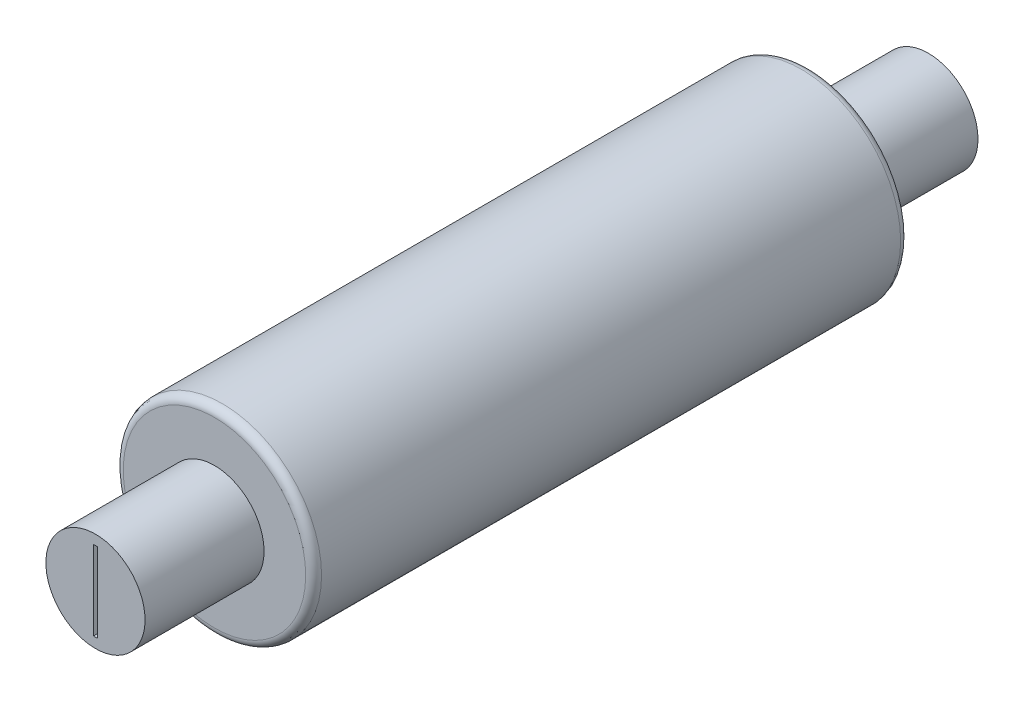
ISO-10303-21;
HEADER;
FILE_DESCRIPTION(('STEP AP214'),'2;1');
FILE_NAME('part.step','',(''),(''),'','','');
FILE_SCHEMA(('AUTOMOTIVE_DESIGN { 1 0 10303 214 1 1 1 1 }'));
ENDSEC;
DATA;
#1=APPLICATION_CONTEXT('core data for automotive mechanical design processes');
#2=APPLICATION_PROTOCOL_DEFINITION('international standard','automotive_design',2000,#1);
#3=PRODUCT_CONTEXT('',#1,'mechanical');
#4=PRODUCT('Part','Part','',(#3));
#5=PRODUCT_RELATED_PRODUCT_CATEGORY('part','',(#4));
#6=PRODUCT_DEFINITION_FORMATION('','',#4);
#7=PRODUCT_DEFINITION_CONTEXT('part definition',#1,'design');
#8=PRODUCT_DEFINITION('design','',#6,#7);
#9=PRODUCT_DEFINITION_SHAPE('','',#8);
#10=(LENGTH_UNIT() NAMED_UNIT(*) SI_UNIT(.MILLI.,.METRE.));
#11=(NAMED_UNIT(*) PLANE_ANGLE_UNIT() SI_UNIT($,.RADIAN.));
#12=(NAMED_UNIT(*) SI_UNIT($,.STERADIAN.) SOLID_ANGLE_UNIT());
#13=UNCERTAINTY_MEASURE_WITH_UNIT(LENGTH_MEASURE(1.E-05),#10,'distance_accuracy_value','');
#14=(GEOMETRIC_REPRESENTATION_CONTEXT(3) GLOBAL_UNCERTAINTY_ASSIGNED_CONTEXT((#13)) GLOBAL_UNIT_ASSIGNED_CONTEXT((#10,
#11,#12)) REPRESENTATION_CONTEXT('',''));
#15=CARTESIAN_POINT('',(0.,0.,0.));
#16=DIRECTION('',(0.,0.,1.));
#17=DIRECTION('',(1.,0.,0.));
#18=AXIS2_PLACEMENT_3D('',#15,#16,#17);
#19=CARTESIAN_POINT('',(0.,0.,75.));
#20=DIRECTION('',(0.,0.,-1.));
#21=DIRECTION('',(-1.,0.,0.));
#22=AXIS2_PLACEMENT_3D('',#19,#20,#21);
#23=CYLINDRICAL_SURFACE('',#22,25.);
#24=CARTESIAN_POINT('',(0.,0.,-73.));
#25=DIRECTION('',(0.,0.,1.));
#26=DIRECTION('',(1.,0.,0.));
#27=AXIS2_PLACEMENT_3D('',#24,#25,#26);
#28=CIRCLE('',#27,25.);
#29=CARTESIAN_POINT('',(25.,0.,-73.));
#30=VERTEX_POINT('',#29);
#31=EDGE_CURVE('E221',#30,#30,#28,.T.);
#32=ORIENTED_EDGE('',*,*,#31,.T.);
#33=EDGE_LOOP('',(#32));
#34=FACE_BOUND('',#33,.T.);
#35=CARTESIAN_POINT('',(0.,0.,73.));
#36=DIRECTION('',(0.,0.,1.));
#37=DIRECTION('',(1.,0.,0.));
#38=AXIS2_PLACEMENT_3D('',#35,#36,#37);
#39=CIRCLE('',#38,25.);
#40=CARTESIAN_POINT('',(25.,0.,73.));
#41=VERTEX_POINT('',#40);
#42=EDGE_CURVE('E217',#41,#41,#39,.F.);
#43=ORIENTED_EDGE('',*,*,#42,.T.);
#44=EDGE_LOOP('',(#43));
#45=FACE_BOUND('',#44,.T.);
#46=ADVANCED_FACE('F44',(#34,#45),#23,.T.);
#47=CARTESIAN_POINT('',(0.,0.,75.));
#48=DIRECTION('',(0.,0.,1.));
#49=DIRECTION('',(1.,0.,0.));
#50=AXIS2_PLACEMENT_3D('',#47,#48,#49);
#51=PLANE('',#50);
#52=CARTESIAN_POINT('',(0.,0.,75.));
#53=DIRECTION('',(0.,0.,1.));
#54=DIRECTION('',(1.,0.,0.));
#55=AXIS2_PLACEMENT_3D('',#52,#53,#54);
#56=CIRCLE('',#55,23.);
#57=CARTESIAN_POINT('',(23.,0.,75.));
#58=VERTEX_POINT('',#57);
#59=EDGE_CURVE('E11',#58,#58,#56,.T.);
#60=ORIENTED_EDGE('',*,*,#59,.T.);
#61=EDGE_LOOP('',(#60));
#62=FACE_BOUND('',#61,.T.);
#63=CARTESIAN_POINT('',(0.,0.,75.));
#64=DIRECTION('',(0.,0.,1.));
#65=DIRECTION('',(1.,0.,0.));
#66=AXIS2_PLACEMENT_3D('',#63,#64,#65);
#67=CIRCLE('',#66,12.5);
#68=CARTESIAN_POINT('',(12.5,0.,75.));
#69=VERTEX_POINT('',#68);
#70=EDGE_CURVE('E213',#69,#69,#67,.T.);
#71=ORIENTED_EDGE('',*,*,#70,.F.);
#72=EDGE_LOOP('',(#71));
#73=FACE_BOUND('',#72,.T.);
#74=ADVANCED_FACE('F239',(#62,#73),#51,.T.);
#75=CARTESIAN_POINT('',(0.,0.,-75.));
#76=DIRECTION('',(0.,0.,1.));
#77=DIRECTION('',(1.,0.,0.));
#78=AXIS2_PLACEMENT_3D('',#75,#76,#77);
#79=PLANE('',#78);
#80=CARTESIAN_POINT('',(0.,0.,-75.));
#81=DIRECTION('',(0.,0.,1.));
#82=DIRECTION('',(1.,0.,0.));
#83=AXIS2_PLACEMENT_3D('',#80,#81,#82);
#84=CIRCLE('',#83,23.);
#85=CARTESIAN_POINT('',(23.,0.,-75.));
#86=VERTEX_POINT('',#85);
#87=EDGE_CURVE('E53',#86,#86,#84,.F.);
#88=ORIENTED_EDGE('',*,*,#87,.T.);
#89=EDGE_LOOP('',(#88));
#90=FACE_BOUND('',#89,.T.);
#91=CARTESIAN_POINT('',(0.,0.,-75.));
#92=DIRECTION('',(0.,0.,1.));
#93=DIRECTION('',(1.,0.,0.));
#94=AXIS2_PLACEMENT_3D('',#91,#92,#93);
#95=CIRCLE('',#94,12.5);
#96=CARTESIAN_POINT('',(12.5,0.,-75.));
#97=VERTEX_POINT('',#96);
#98=EDGE_CURVE('E118',#97,#97,#95,.T.);
#99=ORIENTED_EDGE('',*,*,#98,.T.);
#100=EDGE_LOOP('',(#99));
#101=FACE_BOUND('',#100,.T.);
#102=ADVANCED_FACE('F228',(#90,#101),#79,.F.);
#103=CARTESIAN_POINT('',(0.,0.,105.));
#104=DIRECTION('',(0.,0.,1.));
#105=DIRECTION('',(1.,0.,0.));
#106=AXIS2_PLACEMENT_3D('',#103,#104,#105);
#107=PLANE('',#106);
#108=CARTESIAN_POINT('',(0.,0.,105.));
#109=DIRECTION('',(0.,0.,1.));
#110=DIRECTION('',(1.,0.,0.));
#111=AXIS2_PLACEMENT_3D('',#108,#109,#110);
#112=CIRCLE('',#111,12.5);
#113=CARTESIAN_POINT('',(12.5,0.,105.));
#114=VERTEX_POINT('',#113);
#115=EDGE_CURVE('E209',#114,#114,#112,.T.);
#116=ORIENTED_EDGE('',*,*,#115,.T.);
#117=EDGE_LOOP('',(#116));
#118=FACE_BOUND('',#117,.T.);
#119=DIRECTION('',(-1.,0.,0.));
#120=VECTOR('',#119,1.);
#121=CARTESIAN_POINT('',(-0.5,10.,105.));
#122=LINE('',#121,#120);
#123=CARTESIAN_POINT('',(0.5,10.,105.));
#124=VERTEX_POINT('',#123);
#125=CARTESIAN_POINT('',(-0.5,10.,105.));
#126=VERTEX_POINT('',#125);
#127=EDGE_CURVE('E171',#124,#126,#122,.T.);
#128=ORIENTED_EDGE('',*,*,#127,.F.);
#129=DIRECTION('',(0.,1.,0.));
#130=VECTOR('',#129,1.);
#131=CARTESIAN_POINT('',(0.5,-10.,105.));
#132=LINE('',#131,#130);
#133=CARTESIAN_POINT('',(0.5,-10.,105.));
#134=VERTEX_POINT('',#133);
#135=EDGE_CURVE('E168',#134,#124,#132,.T.);
#136=ORIENTED_EDGE('',*,*,#135,.F.);
#137=DIRECTION('',(1.,0.,0.));
#138=VECTOR('',#137,1.);
#139=CARTESIAN_POINT('',(-0.5,-10.,105.));
#140=LINE('',#139,#138);
#141=CARTESIAN_POINT('',(-0.5,-10.,105.));
#142=VERTEX_POINT('',#141);
#143=EDGE_CURVE('E179',#142,#134,#140,.T.);
#144=ORIENTED_EDGE('',*,*,#143,.F.);
#145=DIRECTION('',(0.,-1.,0.));
#146=VECTOR('',#145,1.);
#147=CARTESIAN_POINT('',(-0.5,-10.,105.));
#148=LINE('',#147,#146);
#149=EDGE_CURVE('E175',#126,#142,#148,.T.);
#150=ORIENTED_EDGE('',*,*,#149,.F.);
#151=EDGE_LOOP('',(#128,#136,#144,#150));
#152=FACE_BOUND('',#151,.T.);
#153=ADVANCED_FACE('F256',(#118,#152),#107,.T.);
#154=CARTESIAN_POINT('',(0.,0.,105.));
#155=DIRECTION('',(0.,0.,-1.));
#156=DIRECTION('',(-1.,0.,0.));
#157=AXIS2_PLACEMENT_3D('',#154,#155,#156);
#158=CYLINDRICAL_SURFACE('',#157,12.5);
#159=ORIENTED_EDGE('',*,*,#115,.F.);
#160=EDGE_LOOP('',(#159));
#161=FACE_BOUND('',#160,.T.);
#162=ORIENTED_EDGE('',*,*,#70,.T.);
#163=EDGE_LOOP('',(#162));
#164=FACE_BOUND('',#163,.T.);
#165=ADVANCED_FACE('F253',(#161,#164),#158,.T.);
#166=CARTESIAN_POINT('',(0.5,-10.,105.));
#167=DIRECTION('',(-1.,0.,0.));
#168=DIRECTION('',(0.,0.,1.));
#169=AXIS2_PLACEMENT_3D('',#166,#167,#168);
#170=PLANE('',#169);
#171=DIRECTION('',(0.,1.,0.));
#172=VECTOR('',#171,1.);
#173=CARTESIAN_POINT('',(0.5,-10.,75.));
#174=LINE('',#173,#172);
#175=CARTESIAN_POINT('',(0.5,-10.,75.));
#176=VERTEX_POINT('',#175);
#177=CARTESIAN_POINT('',(0.5,10.,75.));
#178=VERTEX_POINT('',#177);
#179=EDGE_CURVE('E164',#176,#178,#174,.T.);
#180=ORIENTED_EDGE('',*,*,#179,.F.);
#181=DIRECTION('',(0.,0.,-1.));
#182=VECTOR('',#181,1.);
#183=CARTESIAN_POINT('',(0.5,-10.,105.));
#184=LINE('',#183,#182);
#185=EDGE_CURVE('E182',#134,#176,#184,.T.);
#186=ORIENTED_EDGE('',*,*,#185,.F.);
#187=ORIENTED_EDGE('',*,*,#135,.T.);
#188=DIRECTION('',(0.,0.,-1.));
#189=VECTOR('',#188,1.);
#190=CARTESIAN_POINT('',(0.5,10.,105.));
#191=LINE('',#190,#189);
#192=EDGE_CURVE('E205',#124,#178,#191,.T.);
#193=ORIENTED_EDGE('',*,*,#192,.T.);
#194=EDGE_LOOP('',(#180,#186,#187,#193));
#195=FACE_BOUND('',#194,.T.);
#196=ADVANCED_FACE('F255',(#195),#170,.T.);
#197=CARTESIAN_POINT('',(-0.5,10.,105.));
#198=DIRECTION('',(0.,-1.,0.));
#199=DIRECTION('',(0.,0.,-1.));
#200=AXIS2_PLACEMENT_3D('',#197,#198,#199);
#201=PLANE('',#200);
#202=DIRECTION('',(-1.,0.,0.));
#203=VECTOR('',#202,1.);
#204=CARTESIAN_POINT('',(-0.5,10.,75.));
#205=LINE('',#204,#203);
#206=CARTESIAN_POINT('',(-0.5,10.,75.));
#207=VERTEX_POINT('',#206);
#208=EDGE_CURVE('E186',#178,#207,#205,.T.);
#209=ORIENTED_EDGE('',*,*,#208,.F.);
#210=ORIENTED_EDGE('',*,*,#192,.F.);
#211=ORIENTED_EDGE('',*,*,#127,.T.);
#212=DIRECTION('',(0.,0.,-1.));
#213=VECTOR('',#212,1.);
#214=CARTESIAN_POINT('',(-0.5,10.,105.));
#215=LINE('',#214,#213);
#216=EDGE_CURVE('E202',#126,#207,#215,.T.);
#217=ORIENTED_EDGE('',*,*,#216,.T.);
#218=EDGE_LOOP('',(#209,#210,#211,#217));
#219=FACE_BOUND('',#218,.T.);
#220=ADVANCED_FACE('F263',(#219),#201,.T.);
#221=CARTESIAN_POINT('',(-0.5,-10.,105.));
#222=DIRECTION('',(1.,0.,0.));
#223=DIRECTION('',(0.,0.,-1.));
#224=AXIS2_PLACEMENT_3D('',#221,#222,#223);
#225=PLANE('',#224);
#226=DIRECTION('',(0.,-1.,0.));
#227=VECTOR('',#226,1.);
#228=CARTESIAN_POINT('',(-0.5,-10.,75.));
#229=LINE('',#228,#227);
#230=CARTESIAN_POINT('',(-0.5,-10.,75.));
#231=VERTEX_POINT('',#230);
#232=EDGE_CURVE('E190',#207,#231,#229,.T.);
#233=ORIENTED_EDGE('',*,*,#232,.F.);
#234=ORIENTED_EDGE('',*,*,#216,.F.);
#235=ORIENTED_EDGE('',*,*,#149,.T.);
#236=DIRECTION('',(0.,0.,-1.));
#237=VECTOR('',#236,1.);
#238=CARTESIAN_POINT('',(-0.5,-10.,105.));
#239=LINE('',#238,#237);
#240=EDGE_CURVE('E199',#142,#231,#239,.T.);
#241=ORIENTED_EDGE('',*,*,#240,.T.);
#242=EDGE_LOOP('',(#233,#234,#235,#241));
#243=FACE_BOUND('',#242,.T.);
#244=ADVANCED_FACE('F300',(#243),#225,.T.);
#245=CARTESIAN_POINT('',(-0.5,-10.,105.));
#246=DIRECTION('',(0.,1.,0.));
#247=DIRECTION('',(0.,0.,1.));
#248=AXIS2_PLACEMENT_3D('',#245,#246,#247);
#249=PLANE('',#248);
#250=DIRECTION('',(1.,0.,0.));
#251=VECTOR('',#250,1.);
#252=CARTESIAN_POINT('',(-0.5,-10.,75.));
#253=LINE('',#252,#251);
#254=EDGE_CURVE('E172',#231,#176,#253,.T.);
#255=ORIENTED_EDGE('',*,*,#254,.F.);
#256=ORIENTED_EDGE('',*,*,#240,.F.);
#257=ORIENTED_EDGE('',*,*,#143,.T.);
#258=ORIENTED_EDGE('',*,*,#185,.T.);
#259=EDGE_LOOP('',(#255,#256,#257,#258));
#260=FACE_BOUND('',#259,.T.);
#261=ADVANCED_FACE('F297',(#260),#249,.T.);
#262=ORIENTED_EDGE('',*,*,#254,.T.);
#263=ORIENTED_EDGE('',*,*,#179,.T.);
#264=ORIENTED_EDGE('',*,*,#208,.T.);
#265=ORIENTED_EDGE('',*,*,#232,.T.);
#266=EDGE_LOOP('',(#262,#263,#264,#265));
#267=FACE_BOUND('',#266,.T.);
#268=ADVANCED_FACE('F250',(#267),#51,.T.);
#269=CARTESIAN_POINT('',(0.,0.,-105.));
#270=DIRECTION('',(0.,0.,1.));
#271=DIRECTION('',(1.,0.,0.));
#272=AXIS2_PLACEMENT_3D('',#269,#270,#271);
#273=CYLINDRICAL_SURFACE('',#272,12.5);
#274=CARTESIAN_POINT('',(0.,0.,-105.));
#275=DIRECTION('',(0.,0.,1.));
#276=DIRECTION('',(1.,0.,0.));
#277=AXIS2_PLACEMENT_3D('',#274,#275,#276);
#278=CIRCLE('',#277,12.5);
#279=CARTESIAN_POINT('',(12.5,0.,-105.));
#280=VERTEX_POINT('',#279);
#281=EDGE_CURVE('E160',#280,#280,#278,.T.);
#282=ORIENTED_EDGE('',*,*,#281,.T.);
#283=EDGE_LOOP('',(#282));
#284=FACE_BOUND('',#283,.T.);
#285=ORIENTED_EDGE('',*,*,#98,.F.);
#286=EDGE_LOOP('',(#285));
#287=FACE_BOUND('',#286,.T.);
#288=ADVANCED_FACE('F293',(#284,#287),#273,.T.);
#289=CARTESIAN_POINT('',(0.,0.,-105.));
#290=DIRECTION('',(0.,0.,-1.));
#291=DIRECTION('',(1.,0.,0.));
#292=AXIS2_PLACEMENT_3D('',#289,#290,#291);
#293=PLANE('',#292);
#294=DIRECTION('',(0.,1.,0.));
#295=VECTOR('',#294,1.);
#296=CARTESIAN_POINT('',(0.5,-10.,-105.));
#297=LINE('',#296,#295);
#298=CARTESIAN_POINT('',(0.5,-10.,-105.));
#299=VERTEX_POINT('',#298);
#300=CARTESIAN_POINT('',(0.5,10.,-105.));
#301=VERTEX_POINT('',#300);
#302=EDGE_CURVE('E122',#299,#301,#297,.T.);
#303=ORIENTED_EDGE('',*,*,#302,.T.);
#304=DIRECTION('',(-1.,0.,0.));
#305=VECTOR('',#304,1.);
#306=CARTESIAN_POINT('',(-0.5,10.,-105.));
#307=LINE('',#306,#305);
#308=CARTESIAN_POINT('',(-0.5,10.,-105.));
#309=VERTEX_POINT('',#308);
#310=EDGE_CURVE('E137',#301,#309,#307,.T.);
#311=ORIENTED_EDGE('',*,*,#310,.T.);
#312=DIRECTION('',(0.,-1.,0.));
#313=VECTOR('',#312,1.);
#314=CARTESIAN_POINT('',(-0.5,-10.,-105.));
#315=LINE('',#314,#313);
#316=CARTESIAN_POINT('',(-0.5,-10.,-105.));
#317=VERTEX_POINT('',#316);
#318=EDGE_CURVE('E133',#309,#317,#315,.T.);
#319=ORIENTED_EDGE('',*,*,#318,.T.);
#320=DIRECTION('',(1.,0.,0.));
#321=VECTOR('',#320,1.);
#322=CARTESIAN_POINT('',(-0.5,-10.,-105.));
#323=LINE('',#322,#321);
#324=EDGE_CURVE('E113',#317,#299,#323,.T.);
#325=ORIENTED_EDGE('',*,*,#324,.T.);
#326=EDGE_LOOP('',(#303,#311,#319,#325));
#327=FACE_BOUND('',#326,.T.);
#328=ORIENTED_EDGE('',*,*,#281,.F.);
#329=EDGE_LOOP('',(#328));
#330=FACE_BOUND('',#329,.T.);
#331=ADVANCED_FACE('F131',(#327,#330),#293,.T.);
#332=CARTESIAN_POINT('',(0.5,-10.,-105.));
#333=DIRECTION('',(1.,0.,0.));
#334=DIRECTION('',(0.,0.,-1.));
#335=AXIS2_PLACEMENT_3D('',#332,#333,#334);
#336=PLANE('',#335);
#337=DIRECTION('',(0.,1.,0.));
#338=VECTOR('',#337,1.);
#339=CARTESIAN_POINT('',(0.5,-10.,-75.));
#340=LINE('',#339,#338);
#341=CARTESIAN_POINT('',(0.5,-10.,-75.));
#342=VERTEX_POINT('',#341);
#343=CARTESIAN_POINT('',(0.5,10.,-75.));
#344=VERTEX_POINT('',#343);
#345=EDGE_CURVE('E64',#342,#344,#340,.T.);
#346=ORIENTED_EDGE('',*,*,#345,.T.);
#347=DIRECTION('',(0.,0.,1.));
#348=VECTOR('',#347,1.);
#349=CARTESIAN_POINT('',(0.5,10.,-105.));
#350=LINE('',#349,#348);
#351=EDGE_CURVE('E125',#301,#344,#350,.T.);
#352=ORIENTED_EDGE('',*,*,#351,.F.);
#353=ORIENTED_EDGE('',*,*,#302,.F.);
#354=DIRECTION('',(0.,0.,1.));
#355=VECTOR('',#354,1.);
#356=CARTESIAN_POINT('',(0.5,-10.,-105.));
#357=LINE('',#356,#355);
#358=EDGE_CURVE('E108',#299,#342,#357,.T.);
#359=ORIENTED_EDGE('',*,*,#358,.T.);
#360=EDGE_LOOP('',(#346,#352,#353,#359));
#361=FACE_BOUND('',#360,.T.);
#362=ADVANCED_FACE('F123',(#361),#336,.F.);
#363=CARTESIAN_POINT('',(-0.5,-10.,-105.));
#364=DIRECTION('',(0.,-1.,0.));
#365=DIRECTION('',(0.,0.,-1.));
#366=AXIS2_PLACEMENT_3D('',#363,#364,#365);
#367=PLANE('',#366);
#368=DIRECTION('',(1.,0.,0.));
#369=VECTOR('',#368,1.);
#370=CARTESIAN_POINT('',(-0.5,-10.,-75.));
#371=LINE('',#370,#369);
#372=CARTESIAN_POINT('',(-0.5,-10.,-75.));
#373=VERTEX_POINT('',#372);
#374=EDGE_CURVE('E115',#373,#342,#371,.T.);
#375=ORIENTED_EDGE('',*,*,#374,.T.);
#376=ORIENTED_EDGE('',*,*,#358,.F.);
#377=ORIENTED_EDGE('',*,*,#324,.F.);
#378=DIRECTION('',(0.,0.,1.));
#379=VECTOR('',#378,1.);
#380=CARTESIAN_POINT('',(-0.5,-10.,-105.));
#381=LINE('',#380,#379);
#382=EDGE_CURVE('E119',#317,#373,#381,.T.);
#383=ORIENTED_EDGE('',*,*,#382,.T.);
#384=EDGE_LOOP('',(#375,#376,#377,#383));
#385=FACE_BOUND('',#384,.T.);
#386=ADVANCED_FACE('F110',(#385),#367,.F.);
#387=CARTESIAN_POINT('',(-0.5,-10.,-105.));
#388=DIRECTION('',(-1.,0.,0.));
#389=DIRECTION('',(0.,0.,1.));
#390=AXIS2_PLACEMENT_3D('',#387,#388,#389);
#391=PLANE('',#390);
#392=DIRECTION('',(0.,-1.,0.));
#393=VECTOR('',#392,1.);
#394=CARTESIAN_POINT('',(-0.5,-10.,-75.));
#395=LINE('',#394,#393);
#396=CARTESIAN_POINT('',(-0.5,10.,-75.));
#397=VERTEX_POINT('',#396);
#398=EDGE_CURVE('E146',#397,#373,#395,.T.);
#399=ORIENTED_EDGE('',*,*,#398,.T.);
#400=ORIENTED_EDGE('',*,*,#382,.F.);
#401=ORIENTED_EDGE('',*,*,#318,.F.);
#402=DIRECTION('',(0.,0.,1.));
#403=VECTOR('',#402,1.);
#404=CARTESIAN_POINT('',(-0.5,10.,-105.));
#405=LINE('',#404,#403);
#406=EDGE_CURVE('E154',#309,#397,#405,.T.);
#407=ORIENTED_EDGE('',*,*,#406,.T.);
#408=EDGE_LOOP('',(#399,#400,#401,#407));
#409=FACE_BOUND('',#408,.T.);
#410=ADVANCED_FACE('F278',(#409),#391,.F.);
#411=CARTESIAN_POINT('',(-0.5,10.,-105.));
#412=DIRECTION('',(0.,1.,0.));
#413=DIRECTION('',(0.,0.,1.));
#414=AXIS2_PLACEMENT_3D('',#411,#412,#413);
#415=PLANE('',#414);
#416=DIRECTION('',(-1.,0.,0.));
#417=VECTOR('',#416,1.);
#418=CARTESIAN_POINT('',(-0.5,10.,-75.));
#419=LINE('',#418,#417);
#420=EDGE_CURVE('E60',#344,#397,#419,.T.);
#421=ORIENTED_EDGE('',*,*,#420,.T.);
#422=ORIENTED_EDGE('',*,*,#406,.F.);
#423=ORIENTED_EDGE('',*,*,#310,.F.);
#424=ORIENTED_EDGE('',*,*,#351,.T.);
#425=EDGE_LOOP('',(#421,#422,#423,#424));
#426=FACE_BOUND('',#425,.T.);
#427=ADVANCED_FACE('F274',(#426),#415,.F.);
#428=ORIENTED_EDGE('',*,*,#420,.F.);
#429=ORIENTED_EDGE('',*,*,#345,.F.);
#430=ORIENTED_EDGE('',*,*,#374,.F.);
#431=ORIENTED_EDGE('',*,*,#398,.F.);
#432=EDGE_LOOP('',(#428,#429,#430,#431));
#433=FACE_BOUND('',#432,.T.);
#434=ADVANCED_FACE('F234',(#433),#79,.F.);
#435=CARTESIAN_POINT('',(0.,0.,-73.));
#436=DIRECTION('',(0.,0.,1.));
#437=DIRECTION('',(1.,0.,0.));
#438=AXIS2_PLACEMENT_3D('',#435,#436,#437);
#439=TOROIDAL_SURFACE('',#438,23.,2.);
#440=ORIENTED_EDGE('',*,*,#87,.F.);
#441=EDGE_LOOP('',(#440));
#442=FACE_BOUND('',#441,.T.);
#443=ORIENTED_EDGE('',*,*,#31,.F.);
#444=EDGE_LOOP('',(#443));
#445=FACE_BOUND('',#444,.T.);
#446=ADVANCED_FACE('F231',(#442,#445),#439,.T.);
#447=CARTESIAN_POINT('',(0.,0.,73.));
#448=DIRECTION('',(0.,0.,1.));
#449=DIRECTION('',(1.,0.,0.));
#450=AXIS2_PLACEMENT_3D('',#447,#448,#449);
#451=TOROIDAL_SURFACE('',#450,23.,2.);
#452=ORIENTED_EDGE('',*,*,#42,.F.);
#453=EDGE_LOOP('',(#452));
#454=FACE_BOUND('',#453,.T.);
#455=ORIENTED_EDGE('',*,*,#59,.F.);
#456=EDGE_LOOP('',(#455));
#457=FACE_BOUND('',#456,.T.);
#458=ADVANCED_FACE('F46',(#454,#457),#451,.T.);
#459=CLOSED_SHELL('',(#46,#74,#102,#153,#165,#196,#220,#244,#261,#268,#288,#331,#362,#386,#410,
#427,#434,#446,#458));
#460=MANIFOLD_SOLID_BREP('B2',#459);
#461=ADVANCED_BREP_SHAPE_REPRESENTATION('',(#18,#460),#14);
#462=SHAPE_DEFINITION_REPRESENTATION(#9,#461);
ENDSEC;
END-ISO-10303-21;
